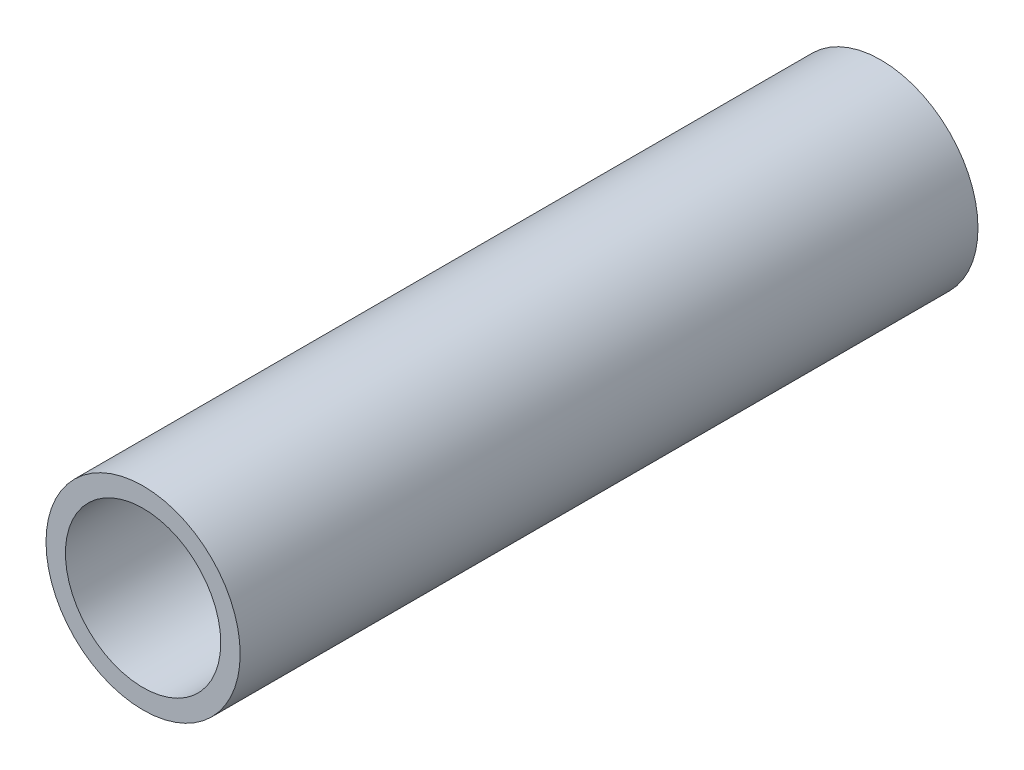
ISO-10303-21;
HEADER;
FILE_DESCRIPTION(('STEP AP214'),'2;1');
FILE_NAME('part.step','',(''),(''),'','','');
FILE_SCHEMA(('AUTOMOTIVE_DESIGN { 1 0 10303 214 1 1 1 1 }'));
ENDSEC;
DATA;
#1=APPLICATION_CONTEXT('core data for automotive mechanical design processes');
#2=APPLICATION_PROTOCOL_DEFINITION('international standard','automotive_design',2000,#1);
#3=PRODUCT_CONTEXT('',#1,'mechanical');
#4=PRODUCT('Part','Part','',(#3));
#5=PRODUCT_RELATED_PRODUCT_CATEGORY('part','',(#4));
#6=PRODUCT_DEFINITION_FORMATION('','',#4);
#7=PRODUCT_DEFINITION_CONTEXT('part definition',#1,'design');
#8=PRODUCT_DEFINITION('design','',#6,#7);
#9=PRODUCT_DEFINITION_SHAPE('','',#8);
#10=(LENGTH_UNIT() NAMED_UNIT(*) SI_UNIT(.MILLI.,.METRE.));
#11=(NAMED_UNIT(*) PLANE_ANGLE_UNIT() SI_UNIT($,.RADIAN.));
#12=(NAMED_UNIT(*) SI_UNIT($,.STERADIAN.) SOLID_ANGLE_UNIT());
#13=UNCERTAINTY_MEASURE_WITH_UNIT(LENGTH_MEASURE(1.E-05),#10,'distance_accuracy_value','');
#14=(GEOMETRIC_REPRESENTATION_CONTEXT(3) GLOBAL_UNCERTAINTY_ASSIGNED_CONTEXT((#13)) GLOBAL_UNIT_ASSIGNED_CONTEXT((#10,
#11,#12)) REPRESENTATION_CONTEXT('',''));
#15=CARTESIAN_POINT('',(0.,0.,0.));
#16=DIRECTION('',(0.,0.,1.));
#17=DIRECTION('',(1.,0.,0.));
#18=AXIS2_PLACEMENT_3D('',#15,#16,#17);
#19=CARTESIAN_POINT('',(0.,0.,9.5));
#20=DIRECTION('',(0.,0.,1.));
#21=DIRECTION('',(1.,0.,0.));
#22=AXIS2_PLACEMENT_3D('',#19,#20,#21);
#23=PLANE('',#22);
#24=CARTESIAN_POINT('',(0.,0.,9.5));
#25=DIRECTION('',(0.,0.,1.));
#26=DIRECTION('',(1.,0.,0.));
#27=AXIS2_PLACEMENT_3D('',#24,#25,#26);
#28=CIRCLE('',#27,1.25);
#29=CARTESIAN_POINT('',(1.25,0.,9.5));
#30=VERTEX_POINT('',#29);
#31=EDGE_CURVE('E10',#30,#30,#28,.T.);
#32=ORIENTED_EDGE('',*,*,#31,.T.);
#33=EDGE_LOOP('',(#32));
#34=FACE_BOUND('',#33,.T.);
#35=CARTESIAN_POINT('',(0.,0.,9.5));
#36=DIRECTION('',(0.,0.,1.));
#37=DIRECTION('',(1.,0.,0.));
#38=AXIS2_PLACEMENT_3D('',#35,#36,#37);
#39=CIRCLE('',#38,1.);
#40=CARTESIAN_POINT('',(1.,0.,9.5));
#41=VERTEX_POINT('',#40);
#42=EDGE_CURVE('E42',#41,#41,#39,.T.);
#43=ORIENTED_EDGE('',*,*,#42,.F.);
#44=EDGE_LOOP('',(#43));
#45=FACE_BOUND('',#44,.T.);
#46=ADVANCED_FACE('F31',(#34,#45),#23,.T.);
#47=CARTESIAN_POINT('',(0.,0.,0.));
#48=DIRECTION('',(0.,0.,1.));
#49=DIRECTION('',(1.,0.,0.));
#50=AXIS2_PLACEMENT_3D('',#47,#48,#49);
#51=PLANE('',#50);
#52=CARTESIAN_POINT('',(0.,0.,0.));
#53=DIRECTION('',(0.,0.,1.));
#54=DIRECTION('',(1.,0.,0.));
#55=AXIS2_PLACEMENT_3D('',#52,#53,#54);
#56=CIRCLE('',#55,1.25);
#57=CARTESIAN_POINT('',(1.25,0.,0.));
#58=VERTEX_POINT('',#57);
#59=EDGE_CURVE('E35',#58,#58,#56,.T.);
#60=ORIENTED_EDGE('',*,*,#59,.F.);
#61=EDGE_LOOP('',(#60));
#62=FACE_BOUND('',#61,.T.);
#63=CARTESIAN_POINT('',(0.,0.,0.));
#64=DIRECTION('',(0.,0.,1.));
#65=DIRECTION('',(1.,0.,0.));
#66=AXIS2_PLACEMENT_3D('',#63,#64,#65);
#67=CIRCLE('',#66,1.);
#68=CARTESIAN_POINT('',(1.,0.,0.));
#69=VERTEX_POINT('',#68);
#70=EDGE_CURVE('E44',#69,#69,#67,.T.);
#71=ORIENTED_EDGE('',*,*,#70,.T.);
#72=EDGE_LOOP('',(#71));
#73=FACE_BOUND('',#72,.T.);
#74=ADVANCED_FACE('F54',(#62,#73),#51,.F.);
#75=CARTESIAN_POINT('',(0.,0.,9.5));
#76=DIRECTION('',(0.,0.,-1.));
#77=DIRECTION('',(-1.,0.,0.));
#78=AXIS2_PLACEMENT_3D('',#75,#76,#77);
#79=CYLINDRICAL_SURFACE('',#78,1.25);
#80=ORIENTED_EDGE('',*,*,#31,.F.);
#81=EDGE_LOOP('',(#80));
#82=FACE_BOUND('',#81,.T.);
#83=ORIENTED_EDGE('',*,*,#59,.T.);
#84=EDGE_LOOP('',(#83));
#85=FACE_BOUND('',#84,.T.);
#86=ADVANCED_FACE('F33',(#82,#85),#79,.T.);
#87=CARTESIAN_POINT('',(0.,0.,9.5));
#88=DIRECTION('',(0.,0.,-1.));
#89=DIRECTION('',(-1.,0.,0.));
#90=AXIS2_PLACEMENT_3D('',#87,#88,#89);
#91=CYLINDRICAL_SURFACE('',#90,1.);
#92=ORIENTED_EDGE('',*,*,#42,.T.);
#93=EDGE_LOOP('',(#92));
#94=FACE_BOUND('',#93,.T.);
#95=ORIENTED_EDGE('',*,*,#70,.F.);
#96=EDGE_LOOP('',(#95));
#97=FACE_BOUND('',#96,.T.);
#98=ADVANCED_FACE('F50',(#94,#97),#91,.F.);
#99=CLOSED_SHELL('',(#46,#74,#86,#98));
#100=MANIFOLD_SOLID_BREP('B2',#99);
#101=ADVANCED_BREP_SHAPE_REPRESENTATION('',(#18,#100),#14);
#102=SHAPE_DEFINITION_REPRESENTATION(#9,#101);
ENDSEC;
END-ISO-10303-21;
